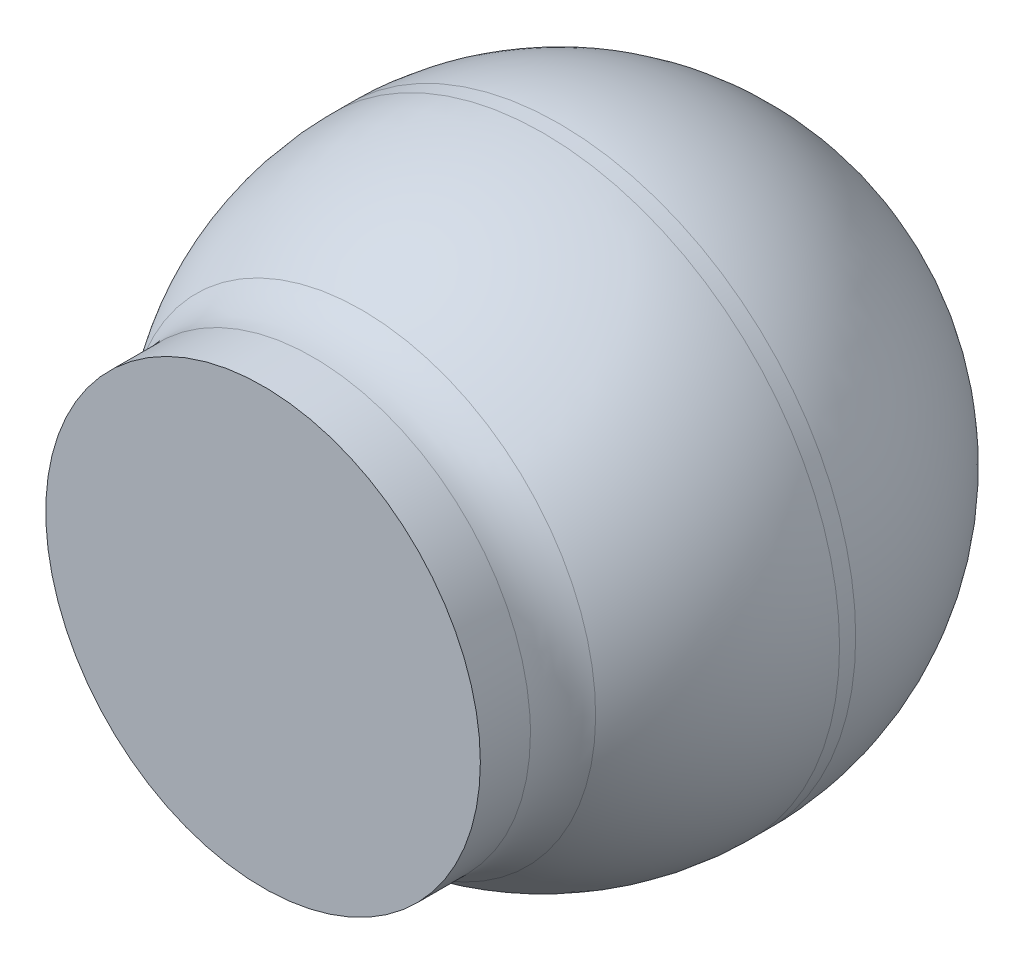
ISO-10303-21;
HEADER;
FILE_DESCRIPTION(('STEP AP214'),'2;1');
FILE_NAME('part.step','',(''),(''),'','','');
FILE_SCHEMA(('AUTOMOTIVE_DESIGN { 1 0 10303 214 1 1 1 1 }'));
ENDSEC;
DATA;
#1=APPLICATION_CONTEXT('core data for automotive mechanical design processes');
#2=APPLICATION_PROTOCOL_DEFINITION('international standard','automotive_design',2000,#1);
#3=PRODUCT_CONTEXT('',#1,'mechanical');
#4=PRODUCT('Part','Part','',(#3));
#5=PRODUCT_RELATED_PRODUCT_CATEGORY('part','',(#4));
#6=PRODUCT_DEFINITION_FORMATION('','',#4);
#7=PRODUCT_DEFINITION_CONTEXT('part definition',#1,'design');
#8=PRODUCT_DEFINITION('design','',#6,#7);
#9=PRODUCT_DEFINITION_SHAPE('','',#8);
#10=(LENGTH_UNIT() NAMED_UNIT(*) SI_UNIT(.MILLI.,.METRE.));
#11=(NAMED_UNIT(*) PLANE_ANGLE_UNIT() SI_UNIT($,.RADIAN.));
#12=(NAMED_UNIT(*) SI_UNIT($,.STERADIAN.) SOLID_ANGLE_UNIT());
#13=UNCERTAINTY_MEASURE_WITH_UNIT(LENGTH_MEASURE(1.E-05),#10,'distance_accuracy_value','');
#14=(GEOMETRIC_REPRESENTATION_CONTEXT(3) GLOBAL_UNCERTAINTY_ASSIGNED_CONTEXT((#13)) GLOBAL_UNIT_ASSIGNED_CONTEXT((#10,
#11,#12)) REPRESENTATION_CONTEXT('',''));
#15=CARTESIAN_POINT('',(0.,0.,0.));
#16=DIRECTION('',(0.,0.,1.));
#17=DIRECTION('',(1.,0.,0.));
#18=AXIS2_PLACEMENT_3D('',#15,#16,#17);
#19=CARTESIAN_POINT('',(-3.102919922269,-9.131349291452,10.006534503384));
#20=DIRECTION('',(0.,0.,-1.));
#21=DIRECTION('',(-1.,0.,0.));
#22=AXIS2_PLACEMENT_3D('',#19,#20,#21);
#23=PLANE('',#22);
#24=CARTESIAN_POINT('',(-3.102919922269,-9.131349291452,10.006534503384));
#25=DIRECTION('',(0.,0.,1.));
#26=DIRECTION('',(1.,0.,0.));
#27=AXIS2_PLACEMENT_3D('',#24,#25,#26);
#28=CIRCLE('',#27,0.275);
#29=CARTESIAN_POINT('',(-2.827919922269,-9.131349291452,10.006534503384));
#30=VERTEX_POINT('',#29);
#31=EDGE_CURVE('E20',#30,#30,#28,.F.);
#32=ORIENTED_EDGE('',*,*,#31,.F.);
#33=EDGE_LOOP('',(#32));
#34=FACE_BOUND('',#33,.T.);
#35=ADVANCED_FACE('F17',(#34),#23,.F.);
#36=CARTESIAN_POINT('',(-3.102919922269,-9.131349291452,9.906534503384));
#37=DIRECTION('',(0.,0.,1.));
#38=DIRECTION('',(1.,0.,0.));
#39=AXIS2_PLACEMENT_3D('',#36,#37,#38);
#40=CYLINDRICAL_SURFACE('',#39,0.275);
#41=CARTESIAN_POINT('',(-3.102919922269,-9.131349291452,9.943180457728));
#42=DIRECTION('',(0.,0.,-1.));
#43=DIRECTION('',(0.996700902337582,0.081162252799247,0.));
#44=AXIS2_PLACEMENT_3D('',#41,#42,#43);
#45=CIRCLE('',#44,0.275);
#46=CARTESIAN_POINT('',(-2.82882717412616,-9.10902967193221,9.943180457728));
#47=VERTEX_POINT('',#46);
#48=EDGE_CURVE('E65',#47,#47,#45,.F.);
#49=ORIENTED_EDGE('',*,*,#48,.T.);
#50=EDGE_LOOP('',(#49));
#51=FACE_BOUND('',#50,.T.);
#52=ORIENTED_EDGE('',*,*,#31,.T.);
#53=EDGE_LOOP('',(#52));
#54=FACE_BOUND('',#53,.T.);
#55=ADVANCED_FACE('F62',(#51,#54),#40,.T.);
#56=CARTESIAN_POINT('',(-3.102919922269,-9.131349291452,9.943180457728));
#57=DIRECTION('',(0.,0.,-1.));
#58=DIRECTION('',(0.996700902337583,0.0811622527992448,0.));
#59=AXIS2_PLACEMENT_3D('',#56,#57,#58);
#60=TOROIDAL_SURFACE('',#59,0.375,0.1);
#61=ORIENTED_EDGE('',*,*,#48,.F.);
#62=EDGE_LOOP('',(#61));
#63=FACE_BOUND('',#62,.T.);
#64=CARTESIAN_POINT('',(-3.102919922269,-9.131349291452,9.881744931236));
#65=DIRECTION('',(0.,0.,-1.));
#66=DIRECTION('',(-0.996700902337598,-0.0811622527990621,0.));
#67=AXIS2_PLACEMENT_3D('',#64,#65,#66);
#68=CIRCLE('',#67,0.296097046412665);
#69=CARTESIAN_POINT('',(-3.398040115608,-9.155381194786,9.881744931236));
#70=VERTEX_POINT('',#69);
#71=EDGE_CURVE('E39',#70,#70,#68,.T.);
#72=ORIENTED_EDGE('',*,*,#71,.F.);
#73=EDGE_LOOP('',(#72));
#74=FACE_BOUND('',#73,.T.);
#75=ADVANCED_FACE('F57',(#63,#74),#60,.F.);
#76=CARTESIAN_POINT('',(-3.476682760645,-9.161785136252,9.651976062157));
#77=CARTESIAN_POINT('',(-3.476682760645,-9.161785136252,9.701461392103));
#78=CARTESIAN_POINT('',(-3.468526217348,-9.161120941579,9.750947004335));
#79=CARTESIAN_POINT('',(-3.452207085349,-9.159792059952,9.798626332798));
#80=CARTESIAN_POINT('',(-3.428341390838,-9.157848654938,9.842699544317));
#81=CARTESIAN_POINT('',(-3.398040115608,-9.155381194786,9.881744931236));
#82=(BOUNDED_CURVE() B_SPLINE_CURVE(5,(#76,#77,#78,#79,#80,#81),.UNSPECIFIED.,.F.,
.F.) B_SPLINE_CURVE_WITH_KNOTS((6,6),(0.,0.661568582165),
.UNSPECIFIED.) CURVE() GEOMETRIC_REPRESENTATION_ITEM() RATIONAL_B_SPLINE_CURVE((1.,1.,1.,1.,1.,1.)) REPRESENTATION_ITEM(''));
#83=CARTESIAN_POINT('',(-3.102919922269,-9.131349291452,9.651976062157));
#84=DIRECTION('',(0.,0.,-1.));
#85=AXIS1_PLACEMENT('',#83,#84);
#86=SURFACE_OF_REVOLUTION('',#82,#85);
#87=CARTESIAN_POINT('',(-3.102919922269,-9.131349291452,9.651976062157));
#88=DIRECTION('',(0.,0.,1.));
#89=DIRECTION('',(1.,0.,0.));
#90=AXIS2_PLACEMENT_3D('',#87,#88,#89);
#91=CIRCLE('',#90,0.375);
#92=CARTESIAN_POINT('',(-2.727919922269,-9.131349291452,9.651976062157));
#93=VERTEX_POINT('',#92);
#94=EDGE_CURVE('E36',#93,#93,#91,.F.);
#95=ORIENTED_EDGE('',*,*,#94,.F.);
#96=EDGE_LOOP('',(#95));
#97=FACE_BOUND('',#96,.T.);
#98=ORIENTED_EDGE('',*,*,#71,.T.);
#99=EDGE_LOOP('',(#98));
#100=FACE_BOUND('',#99,.T.);
#101=ADVANCED_FACE('F53',(#97,#100),#86,.F.);
#102=CARTESIAN_POINT('',(-3.102919922269,-9.131349291452,9.256534503384));
#103=DIRECTION('',(0.,0.,1.));
#104=DIRECTION('',(1.,0.,0.));
#105=AXIS2_PLACEMENT_3D('',#102,#103,#104);
#106=CYLINDRICAL_SURFACE('',#105,0.375);
#107=CARTESIAN_POINT('',(-3.102919922269,-9.131349291452,9.631534503384));
#108=DIRECTION('',(0.,0.,-1.));
#109=DIRECTION('',(0.0811622527992357,-0.996700902337583,0.));
#110=AXIS2_PLACEMENT_3D('',#107,#108,#109);
#111=CIRCLE('',#110,0.375);
#112=CARTESIAN_POINT('',(-3.07248407746929,-9.50511212982859,9.631534503384));
#113=VERTEX_POINT('',#112);
#114=CARTESIAN_POINT('',(-3.13335576706871,-8.75758645307541,9.631534503384));
#115=VERTEX_POINT('',#114);
#116=EDGE_CURVE('E11',#113,#115,#111,.T.);
#117=ORIENTED_EDGE('',*,*,#116,.F.);
#118=CARTESIAN_POINT('',(-3.102919922269,-9.131349291452,9.631534503384));
#119=DIRECTION('',(0.,0.,1.));
#120=DIRECTION('',(0.0811622527992365,-0.996700902337583,0.));
#121=AXIS2_PLACEMENT_3D('',#118,#119,#120);
#122=CIRCLE('',#121,0.375);
#123=EDGE_CURVE('E25',#115,#113,#122,.F.);
#124=ORIENTED_EDGE('',*,*,#123,.F.);
#125=EDGE_LOOP('',(#117,#124));
#126=FACE_BOUND('',#125,.T.);
#127=ORIENTED_EDGE('',*,*,#94,.T.);
#128=EDGE_LOOP('',(#127));
#129=FACE_BOUND('',#128,.T.);
#130=ADVANCED_FACE('F34',(#126,#129),#106,.T.);
#131=CARTESIAN_POINT('',(-3.102919922269,-9.131349291452,9.631534503384));
#132=DIRECTION('',(0.0811622527992361,-0.996700902337583,0.));
#133=DIRECTION('',(-0.996700902337583,-0.0811622527992361,0.));
#134=AXIS2_PLACEMENT_3D('',#131,#132,#133);
#135=SPHERICAL_SURFACE('',#134,0.375);
#136=ORIENTED_EDGE('',*,*,#123,.T.);
#137=ORIENTED_EDGE('',*,*,#116,.T.);
#138=EDGE_LOOP('',(#136,#137));
#139=FACE_BOUND('',#138,.T.);
#140=ADVANCED_FACE('F32',(#139),#135,.T.);
#141=CLOSED_SHELL('',(#35,#55,#75,#101,#130,#140));
#142=MANIFOLD_SOLID_BREP('B1',#141);
#143=ADVANCED_BREP_SHAPE_REPRESENTATION('',(#18,#142),#14);
#144=SHAPE_DEFINITION_REPRESENTATION(#9,#143);
ENDSEC;
END-ISO-10303-21;
